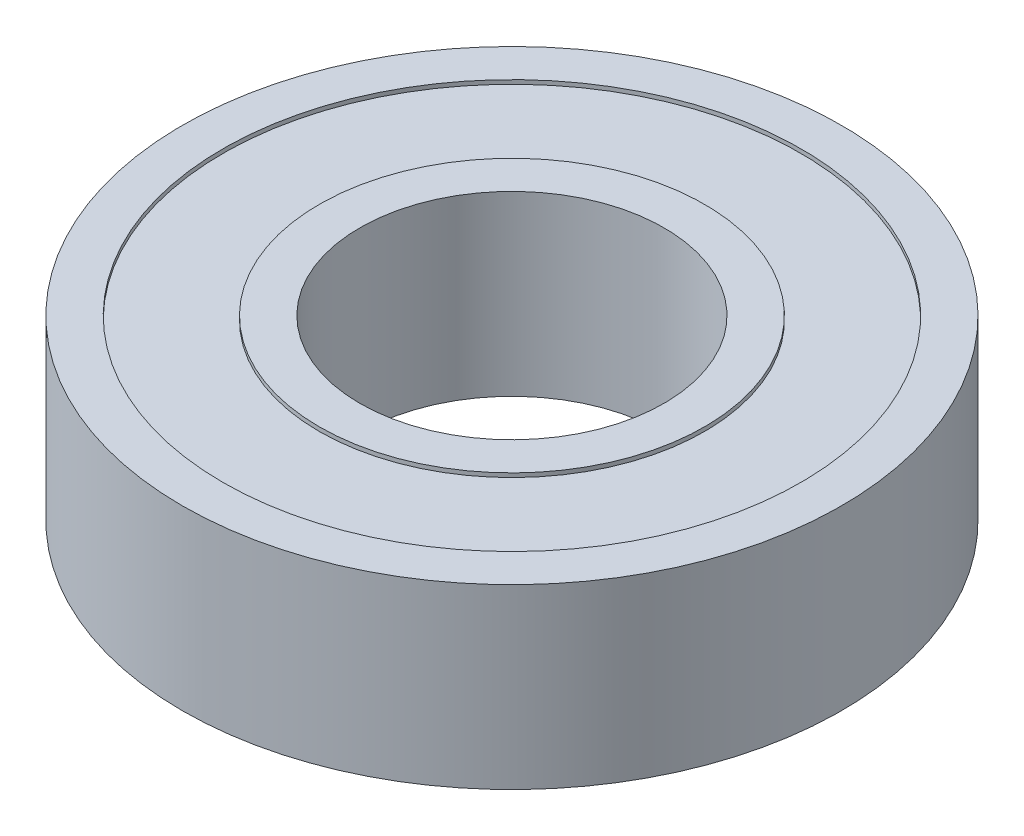
ISO-10303-21;
HEADER;
FILE_DESCRIPTION(('STEP AP214'),'2;1');
FILE_NAME('part.step','',(''),(''),'','','');
FILE_SCHEMA(('AUTOMOTIVE_DESIGN { 1 0 10303 214 1 1 1 1 }'));
ENDSEC;
DATA;
#1=APPLICATION_CONTEXT('core data for automotive mechanical design processes');
#2=APPLICATION_PROTOCOL_DEFINITION('international standard','automotive_design',2000,#1);
#3=PRODUCT_CONTEXT('',#1,'mechanical');
#4=PRODUCT('Part','Part','',(#3));
#5=PRODUCT_RELATED_PRODUCT_CATEGORY('part','',(#4));
#6=PRODUCT_DEFINITION_FORMATION('','',#4);
#7=PRODUCT_DEFINITION_CONTEXT('part definition',#1,'design');
#8=PRODUCT_DEFINITION('design','',#6,#7);
#9=PRODUCT_DEFINITION_SHAPE('','',#8);
#10=(LENGTH_UNIT() NAMED_UNIT(*) SI_UNIT(.MILLI.,.METRE.));
#11=(NAMED_UNIT(*) PLANE_ANGLE_UNIT() SI_UNIT($,.RADIAN.));
#12=(NAMED_UNIT(*) SI_UNIT($,.STERADIAN.) SOLID_ANGLE_UNIT());
#13=UNCERTAINTY_MEASURE_WITH_UNIT(LENGTH_MEASURE(1.E-05),#10,'distance_accuracy_value','');
#14=(GEOMETRIC_REPRESENTATION_CONTEXT(3) GLOBAL_UNCERTAINTY_ASSIGNED_CONTEXT((#13)) GLOBAL_UNIT_ASSIGNED_CONTEXT((#10,
#11,#12)) REPRESENTATION_CONTEXT('',''));
#15=CARTESIAN_POINT('',(0.,0.,0.));
#16=DIRECTION('',(0.,0.,1.));
#17=DIRECTION('',(1.,0.,0.));
#18=AXIS2_PLACEMENT_3D('',#15,#16,#17);
#19=CARTESIAN_POINT('',(0.,28.6205880429407,0.));
#20=DIRECTION('',(0.,1.,0.));
#21=DIRECTION('',(0.,0.,1.));
#22=AXIS2_PLACEMENT_3D('',#19,#20,#21);
#23=CYLINDRICAL_SURFACE('',#22,9.52500000000001);
#24=CARTESIAN_POINT('',(0.,5.55625,0.));
#25=DIRECTION('',(0.,1.,0.));
#26=DIRECTION('',(0.,0.,1.));
#27=AXIS2_PLACEMENT_3D('',#24,#25,#26);
#28=CIRCLE('',#27,9.525);
#29=CARTESIAN_POINT('',(0.,5.55625,9.525));
#30=VERTEX_POINT('',#29);
#31=EDGE_CURVE('E59',#30,#30,#28,.T.);
#32=ORIENTED_EDGE('',*,*,#31,.T.);
#33=EDGE_LOOP('',(#32));
#34=FACE_BOUND('',#33,.T.);
#35=CARTESIAN_POINT('',(0.,-5.55625,0.));
#36=DIRECTION('',(0.,1.,0.));
#37=DIRECTION('',(0.,0.,1.));
#38=AXIS2_PLACEMENT_3D('',#35,#36,#37);
#39=CIRCLE('',#38,9.525);
#40=CARTESIAN_POINT('',(0.,-5.55625,9.525));
#41=VERTEX_POINT('',#40);
#42=EDGE_CURVE('E82',#41,#41,#39,.T.);
#43=ORIENTED_EDGE('',*,*,#42,.F.);
#44=EDGE_LOOP('',(#43));
#45=FACE_BOUND('',#44,.T.);
#46=ADVANCED_FACE('F35',(#34,#45),#23,.F.);
#47=CARTESIAN_POINT('',(0.,28.6205880429407,0.));
#48=DIRECTION('',(0.,1.,0.));
#49=DIRECTION('',(0.,0.,1.));
#50=AXIS2_PLACEMENT_3D('',#47,#48,#49);
#51=CYLINDRICAL_SURFACE('',#50,20.6375);
#52=CARTESIAN_POINT('',(0.,5.55625,0.));
#53=DIRECTION('',(0.,1.,0.));
#54=DIRECTION('',(0.,0.,1.));
#55=AXIS2_PLACEMENT_3D('',#52,#53,#54);
#56=CIRCLE('',#55,20.6375);
#57=CARTESIAN_POINT('',(0.,5.55625,20.6375));
#58=VERTEX_POINT('',#57);
#59=EDGE_CURVE('E10',#58,#58,#56,.T.);
#60=ORIENTED_EDGE('',*,*,#59,.F.);
#61=EDGE_LOOP('',(#60));
#62=FACE_BOUND('',#61,.T.);
#63=CARTESIAN_POINT('',(0.,-5.55625,0.));
#64=DIRECTION('',(0.,1.,0.));
#65=DIRECTION('',(0.,0.,1.));
#66=AXIS2_PLACEMENT_3D('',#63,#64,#65);
#67=CIRCLE('',#66,20.6375);
#68=CARTESIAN_POINT('',(0.,-5.55625,20.6375));
#69=VERTEX_POINT('',#68);
#70=EDGE_CURVE('E63',#69,#69,#67,.T.);
#71=ORIENTED_EDGE('',*,*,#70,.T.);
#72=EDGE_LOOP('',(#71));
#73=FACE_BOUND('',#72,.T.);
#74=ADVANCED_FACE('F90',(#62,#73),#51,.T.);
#75=CARTESIAN_POINT('',(20.6375,5.55625,0.));
#76=DIRECTION('',(0.,-1.,0.));
#77=DIRECTION('',(0.,0.,-1.));
#78=AXIS2_PLACEMENT_3D('',#75,#76,#77);
#79=PLANE('',#78);
#80=CARTESIAN_POINT('',(0.,5.55625,0.));
#81=DIRECTION('',(0.,1.,0.));
#82=DIRECTION('',(0.,0.,1.));
#83=AXIS2_PLACEMENT_3D('',#80,#81,#82);
#84=CIRCLE('',#83,18.0975);
#85=CARTESIAN_POINT('',(0.,5.55625,18.0975));
#86=VERTEX_POINT('',#85);
#87=EDGE_CURVE('E41',#86,#86,#84,.T.);
#88=ORIENTED_EDGE('',*,*,#87,.F.);
#89=EDGE_LOOP('',(#88));
#90=FACE_BOUND('',#89,.T.);
#91=ORIENTED_EDGE('',*,*,#59,.T.);
#92=EDGE_LOOP('',(#91));
#93=FACE_BOUND('',#92,.T.);
#94=ADVANCED_FACE('F95',(#90,#93),#79,.F.);
#95=CARTESIAN_POINT('',(0.,28.6205880429407,0.));
#96=DIRECTION('',(0.,1.,0.));
#97=DIRECTION('',(0.,0.,1.));
#98=AXIS2_PLACEMENT_3D('',#95,#96,#97);
#99=CYLINDRICAL_SURFACE('',#98,18.0975);
#100=CARTESIAN_POINT('',(0.,5.30225,0.));
#101=DIRECTION('',(0.,1.,0.));
#102=DIRECTION('',(0.,0.,1.));
#103=AXIS2_PLACEMENT_3D('',#100,#101,#102);
#104=CIRCLE('',#103,18.0975);
#105=CARTESIAN_POINT('',(0.,5.30225,18.0975));
#106=VERTEX_POINT('',#105);
#107=EDGE_CURVE('E45',#106,#106,#104,.T.);
#108=ORIENTED_EDGE('',*,*,#107,.F.);
#109=EDGE_LOOP('',(#108));
#110=FACE_BOUND('',#109,.T.);
#111=ORIENTED_EDGE('',*,*,#87,.T.);
#112=EDGE_LOOP('',(#111));
#113=FACE_BOUND('',#112,.T.);
#114=ADVANCED_FACE('F115',(#110,#113),#99,.F.);
#115=CARTESIAN_POINT('',(18.0975,5.30225,0.));
#116=DIRECTION('',(0.,-1.,0.));
#117=DIRECTION('',(0.,0.,-1.));
#118=AXIS2_PLACEMENT_3D('',#115,#116,#117);
#119=PLANE('',#118);
#120=CARTESIAN_POINT('',(0.,5.30225,0.));
#121=DIRECTION('',(0.,1.,0.));
#122=DIRECTION('',(0.,0.,1.));
#123=AXIS2_PLACEMENT_3D('',#120,#121,#122);
#124=CIRCLE('',#123,12.065);
#125=CARTESIAN_POINT('',(0.,5.30225,12.065));
#126=VERTEX_POINT('',#125);
#127=EDGE_CURVE('E49',#126,#126,#124,.T.);
#128=ORIENTED_EDGE('',*,*,#127,.F.);
#129=EDGE_LOOP('',(#128));
#130=FACE_BOUND('',#129,.T.);
#131=ORIENTED_EDGE('',*,*,#107,.T.);
#132=EDGE_LOOP('',(#131));
#133=FACE_BOUND('',#132,.T.);
#134=ADVANCED_FACE('F109',(#130,#133),#119,.F.);
#135=CARTESIAN_POINT('',(0.,28.6205880429407,0.));
#136=DIRECTION('',(0.,1.,0.));
#137=DIRECTION('',(0.,0.,1.));
#138=AXIS2_PLACEMENT_3D('',#135,#136,#137);
#139=CYLINDRICAL_SURFACE('',#138,12.065);
#140=CARTESIAN_POINT('',(0.,5.55625,0.));
#141=DIRECTION('',(0.,1.,0.));
#142=DIRECTION('',(0.,0.,1.));
#143=AXIS2_PLACEMENT_3D('',#140,#141,#142);
#144=CIRCLE('',#143,12.065);
#145=CARTESIAN_POINT('',(0.,5.55625,12.065));
#146=VERTEX_POINT('',#145);
#147=EDGE_CURVE('E55',#146,#146,#144,.T.);
#148=ORIENTED_EDGE('',*,*,#147,.F.);
#149=EDGE_LOOP('',(#148));
#150=FACE_BOUND('',#149,.T.);
#151=ORIENTED_EDGE('',*,*,#127,.T.);
#152=EDGE_LOOP('',(#151));
#153=FACE_BOUND('',#152,.T.);
#154=ADVANCED_FACE('F103',(#150,#153),#139,.T.);
#155=CARTESIAN_POINT('',(12.065,5.55625,0.));
#156=DIRECTION('',(0.,-1.,0.));
#157=DIRECTION('',(0.,0.,-1.));
#158=AXIS2_PLACEMENT_3D('',#155,#156,#157);
#159=PLANE('',#158);
#160=ORIENTED_EDGE('',*,*,#31,.F.);
#161=EDGE_LOOP('',(#160));
#162=FACE_BOUND('',#161,.T.);
#163=ORIENTED_EDGE('',*,*,#147,.T.);
#164=EDGE_LOOP('',(#163));
#165=FACE_BOUND('',#164,.T.);
#166=ADVANCED_FACE('F99',(#162,#165),#159,.F.);
#167=CARTESIAN_POINT('',(20.6375,-5.55625,0.));
#168=DIRECTION('',(0.,1.,0.));
#169=DIRECTION('',(0.,0.,-1.));
#170=AXIS2_PLACEMENT_3D('',#167,#168,#169);
#171=PLANE('',#170);
#172=CARTESIAN_POINT('',(0.,-5.55625,0.));
#173=DIRECTION('',(0.,1.,0.));
#174=DIRECTION('',(0.,0.,1.));
#175=AXIS2_PLACEMENT_3D('',#172,#173,#174);
#176=CIRCLE('',#175,18.0975);
#177=CARTESIAN_POINT('',(0.,-5.55625,18.0975));
#178=VERTEX_POINT('',#177);
#179=EDGE_CURVE('E66',#178,#178,#176,.T.);
#180=ORIENTED_EDGE('',*,*,#179,.T.);
#181=EDGE_LOOP('',(#180));
#182=FACE_BOUND('',#181,.T.);
#183=ORIENTED_EDGE('',*,*,#70,.F.);
#184=EDGE_LOOP('',(#183));
#185=FACE_BOUND('',#184,.T.);
#186=ADVANCED_FACE('F102',(#182,#185),#171,.F.);
#187=CARTESIAN_POINT('',(0.,-28.6205880429407,0.));
#188=DIRECTION('',(0.,-1.,0.));
#189=DIRECTION('',(0.,0.,1.));
#190=AXIS2_PLACEMENT_3D('',#187,#188,#189);
#191=CYLINDRICAL_SURFACE('',#190,18.0975);
#192=CARTESIAN_POINT('',(0.,-5.30225,0.));
#193=DIRECTION('',(0.,1.,0.));
#194=DIRECTION('',(0.,0.,1.));
#195=AXIS2_PLACEMENT_3D('',#192,#193,#194);
#196=CIRCLE('',#195,18.0975);
#197=CARTESIAN_POINT('',(0.,-5.30225,18.0975));
#198=VERTEX_POINT('',#197);
#199=EDGE_CURVE('E70',#198,#198,#196,.T.);
#200=ORIENTED_EDGE('',*,*,#199,.T.);
#201=EDGE_LOOP('',(#200));
#202=FACE_BOUND('',#201,.T.);
#203=ORIENTED_EDGE('',*,*,#179,.F.);
#204=EDGE_LOOP('',(#203));
#205=FACE_BOUND('',#204,.T.);
#206=ADVANCED_FACE('F129',(#202,#205),#191,.F.);
#207=CARTESIAN_POINT('',(18.0975,-5.30225,0.));
#208=DIRECTION('',(0.,1.,0.));
#209=DIRECTION('',(0.,0.,-1.));
#210=AXIS2_PLACEMENT_3D('',#207,#208,#209);
#211=PLANE('',#210);
#212=CARTESIAN_POINT('',(0.,-5.30225,0.));
#213=DIRECTION('',(0.,1.,0.));
#214=DIRECTION('',(0.,0.,1.));
#215=AXIS2_PLACEMENT_3D('',#212,#213,#214);
#216=CIRCLE('',#215,12.065);
#217=CARTESIAN_POINT('',(0.,-5.30225,12.065));
#218=VERTEX_POINT('',#217);
#219=EDGE_CURVE('E74',#218,#218,#216,.T.);
#220=ORIENTED_EDGE('',*,*,#219,.T.);
#221=EDGE_LOOP('',(#220));
#222=FACE_BOUND('',#221,.T.);
#223=ORIENTED_EDGE('',*,*,#199,.F.);
#224=EDGE_LOOP('',(#223));
#225=FACE_BOUND('',#224,.T.);
#226=ADVANCED_FACE('F133',(#222,#225),#211,.F.);
#227=CARTESIAN_POINT('',(0.,-28.6205880429407,0.));
#228=DIRECTION('',(0.,-1.,0.));
#229=DIRECTION('',(0.,0.,1.));
#230=AXIS2_PLACEMENT_3D('',#227,#228,#229);
#231=CYLINDRICAL_SURFACE('',#230,12.065);
#232=CARTESIAN_POINT('',(0.,-5.55625,0.));
#233=DIRECTION('',(0.,1.,0.));
#234=DIRECTION('',(0.,0.,1.));
#235=AXIS2_PLACEMENT_3D('',#232,#233,#234);
#236=CIRCLE('',#235,12.065);
#237=CARTESIAN_POINT('',(0.,-5.55625,12.065));
#238=VERTEX_POINT('',#237);
#239=EDGE_CURVE('E78',#238,#238,#236,.T.);
#240=ORIENTED_EDGE('',*,*,#239,.T.);
#241=EDGE_LOOP('',(#240));
#242=FACE_BOUND('',#241,.T.);
#243=ORIENTED_EDGE('',*,*,#219,.F.);
#244=EDGE_LOOP('',(#243));
#245=FACE_BOUND('',#244,.T.);
#246=ADVANCED_FACE('F137',(#242,#245),#231,.T.);
#247=CARTESIAN_POINT('',(12.065,-5.55625,0.));
#248=DIRECTION('',(0.,1.,0.));
#249=DIRECTION('',(0.,0.,-1.));
#250=AXIS2_PLACEMENT_3D('',#247,#248,#249);
#251=PLANE('',#250);
#252=ORIENTED_EDGE('',*,*,#42,.T.);
#253=EDGE_LOOP('',(#252));
#254=FACE_BOUND('',#253,.T.);
#255=ORIENTED_EDGE('',*,*,#239,.F.);
#256=EDGE_LOOP('',(#255));
#257=FACE_BOUND('',#256,.T.);
#258=ADVANCED_FACE('F86',(#254,#257),#251,.F.);
#259=CLOSED_SHELL('',(#46,#74,#94,#114,#134,#154,#166,#186,#206,#226,#246,#258));
#260=MANIFOLD_SOLID_BREP('B2',#259);
#261=ADVANCED_BREP_SHAPE_REPRESENTATION('',(#18,#260),#14);
#262=SHAPE_DEFINITION_REPRESENTATION(#9,#261);
ENDSEC;
END-ISO-10303-21;
